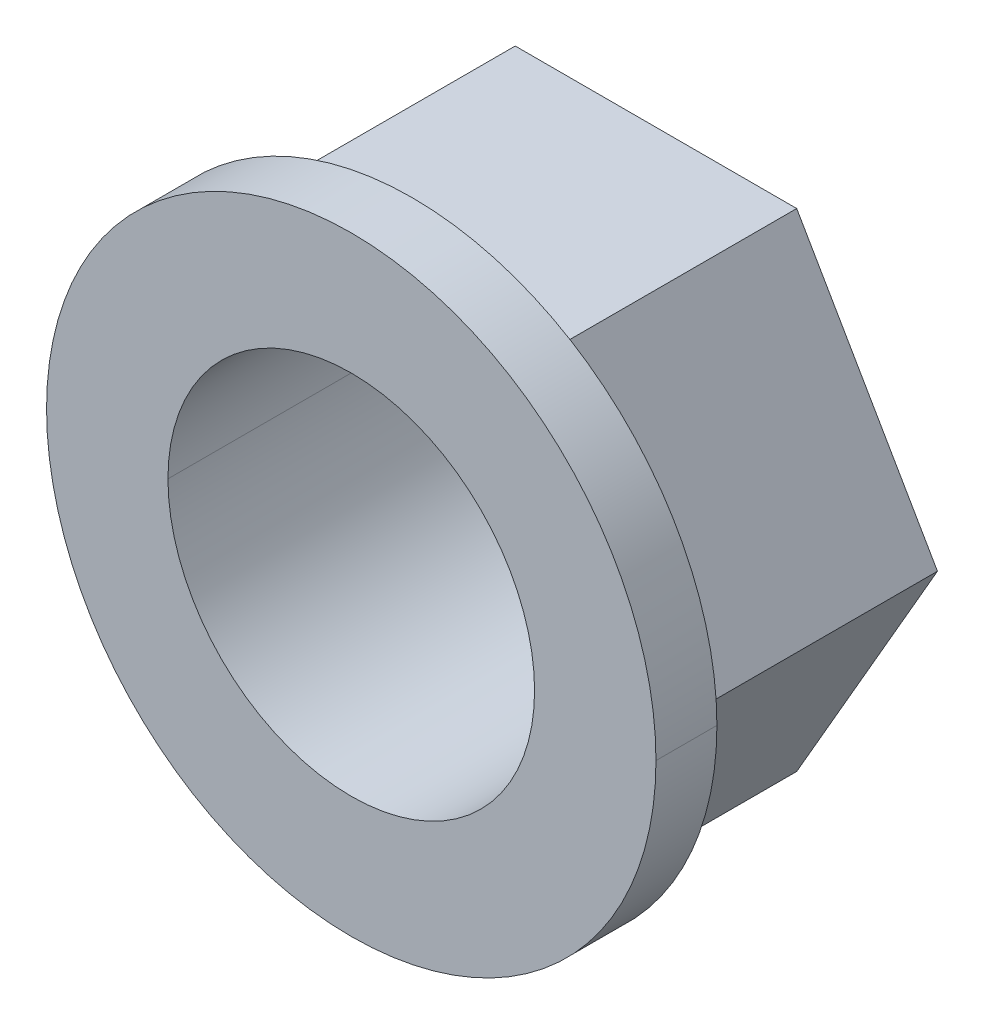
ISO-10303-21;
HEADER;
FILE_DESCRIPTION(('STEP AP214'),'2;1');
FILE_NAME('part.step','',(''),(''),'','','');
FILE_SCHEMA(('AUTOMOTIVE_DESIGN { 1 0 10303 214 1 1 1 1 }'));
ENDSEC;
DATA;
#1=APPLICATION_CONTEXT('core data for automotive mechanical design processes');
#2=APPLICATION_PROTOCOL_DEFINITION('international standard','automotive_design',2000,#1);
#3=PRODUCT_CONTEXT('',#1,'mechanical');
#4=PRODUCT('Part','Part','',(#3));
#5=PRODUCT_RELATED_PRODUCT_CATEGORY('part','',(#4));
#6=PRODUCT_DEFINITION_FORMATION('','',#4);
#7=PRODUCT_DEFINITION_CONTEXT('part definition',#1,'design');
#8=PRODUCT_DEFINITION('design','',#6,#7);
#9=PRODUCT_DEFINITION_SHAPE('','',#8);
#10=(LENGTH_UNIT() NAMED_UNIT(*) SI_UNIT(.MILLI.,.METRE.));
#11=(NAMED_UNIT(*) PLANE_ANGLE_UNIT() SI_UNIT($,.RADIAN.));
#12=(NAMED_UNIT(*) SI_UNIT($,.STERADIAN.) SOLID_ANGLE_UNIT());
#13=UNCERTAINTY_MEASURE_WITH_UNIT(LENGTH_MEASURE(1.E-05),#10,'distance_accuracy_value','');
#14=(GEOMETRIC_REPRESENTATION_CONTEXT(3) GLOBAL_UNCERTAINTY_ASSIGNED_CONTEXT((#13)) GLOBAL_UNIT_ASSIGNED_CONTEXT((#10,
#11,#12)) REPRESENTATION_CONTEXT('',''));
#15=CARTESIAN_POINT('',(0.,0.,0.));
#16=DIRECTION('',(0.,0.,1.));
#17=DIRECTION('',(1.,0.,0.));
#18=AXIS2_PLACEMENT_3D('',#15,#16,#17);
#19=CARTESIAN_POINT('',(0.,0.,1.5875));
#20=DIRECTION('',(0.,0.,-1.));
#21=DIRECTION('',(-1.,0.,0.));
#22=AXIS2_PLACEMENT_3D('',#19,#20,#21);
#23=CYLINDRICAL_SURFACE('',#22,7.9375);
#24=DIRECTION('',(0.,0.,-1.));
#25=VECTOR('',#24,1.);
#26=CARTESIAN_POINT('',(7.9375,0.,1.5875));
#27=LINE('',#26,#25);
#28=CARTESIAN_POINT('',(7.9375,0.,1.5875));
#29=VERTEX_POINT('',#28);
#30=CARTESIAN_POINT('',(7.9375,0.,0.));
#31=VERTEX_POINT('',#30);
#32=EDGE_CURVE('E214',#29,#31,#27,.T.);
#33=ORIENTED_EDGE('',*,*,#32,.F.);
#34=CARTESIAN_POINT('',(0.,0.,1.5875));
#35=DIRECTION('',(0.,0.,1.));
#36=DIRECTION('',(1.,0.,0.));
#37=AXIS2_PLACEMENT_3D('',#34,#35,#36);
#38=CIRCLE('',#37,7.9375);
#39=CARTESIAN_POINT('',(-7.9375,0.,1.5875));
#40=VERTEX_POINT('',#39);
#41=EDGE_CURVE('E11',#40,#29,#38,.T.);
#42=ORIENTED_EDGE('',*,*,#41,.F.);
#43=DIRECTION('',(0.,0.,-1.));
#44=VECTOR('',#43,1.);
#45=CARTESIAN_POINT('',(-7.9375,0.,1.5875));
#46=LINE('',#45,#44);
#47=CARTESIAN_POINT('',(-7.9375,0.,0.));
#48=VERTEX_POINT('',#47);
#49=EDGE_CURVE('E211',#40,#48,#46,.T.);
#50=ORIENTED_EDGE('',*,*,#49,.T.);
#51=CARTESIAN_POINT('',(0.,0.,0.));
#52=DIRECTION('',(0.,0.,1.));
#53=DIRECTION('',(1.,0.,0.));
#54=AXIS2_PLACEMENT_3D('',#51,#52,#53);
#55=CIRCLE('',#54,7.9375);
#56=EDGE_CURVE('E21',#48,#31,#55,.T.);
#57=ORIENTED_EDGE('',*,*,#56,.T.);
#58=EDGE_LOOP('',(#33,#42,#50,#57));
#59=FACE_BOUND('',#58,.T.);
#60=ADVANCED_FACE('F17',(#59),#23,.T.);
#61=CARTESIAN_POINT('',(0.,0.,1.5875));
#62=DIRECTION('',(0.,0.,1.));
#63=DIRECTION('',(1.,0.,0.));
#64=AXIS2_PLACEMENT_3D('',#61,#62,#63);
#65=PLANE('',#64);
#66=CARTESIAN_POINT('',(0.,0.,1.5875));
#67=DIRECTION('',(0.,0.,1.));
#68=DIRECTION('',(1.,0.,0.));
#69=AXIS2_PLACEMENT_3D('',#66,#67,#68);
#70=CIRCLE('',#69,4.7752);
#71=CARTESIAN_POINT('',(4.7752,0.,1.5875));
#72=VERTEX_POINT('',#71);
#73=CARTESIAN_POINT('',(-4.7752,0.,1.5875));
#74=VERTEX_POINT('',#73);
#75=EDGE_CURVE('E131',#72,#74,#70,.T.);
#76=ORIENTED_EDGE('',*,*,#75,.F.);
#77=CARTESIAN_POINT('',(0.,0.,1.5875));
#78=DIRECTION('',(0.,0.,1.));
#79=DIRECTION('',(1.,0.,0.));
#80=AXIS2_PLACEMENT_3D('',#77,#78,#79);
#81=CIRCLE('',#80,4.7752);
#82=EDGE_CURVE('E190',#74,#72,#81,.T.);
#83=ORIENTED_EDGE('',*,*,#82,.F.);
#84=EDGE_LOOP('',(#76,#83));
#85=FACE_BOUND('',#84,.T.);
#86=ORIENTED_EDGE('',*,*,#41,.T.);
#87=CARTESIAN_POINT('',(0.,0.,1.5875));
#88=DIRECTION('',(0.,0.,1.));
#89=DIRECTION('',(1.,0.,0.));
#90=AXIS2_PLACEMENT_3D('',#87,#88,#89);
#91=CIRCLE('',#90,7.9375);
#92=EDGE_CURVE('E219',#29,#40,#91,.T.);
#93=ORIENTED_EDGE('',*,*,#92,.T.);
#94=EDGE_LOOP('',(#86,#93));
#95=FACE_BOUND('',#94,.T.);
#96=ADVANCED_FACE('F269',(#85,#95),#65,.T.);
#97=CARTESIAN_POINT('',(0.,0.,0.));
#98=DIRECTION('',(0.,0.,1.));
#99=DIRECTION('',(1.,0.,0.));
#100=AXIS2_PLACEMENT_3D('',#97,#98,#99);
#101=PLANE('',#100);
#102=DIRECTION('',(1.,0.,0.));
#103=VECTOR('',#102,1.);
#104=CARTESIAN_POINT('',(-3.66617420935412,-6.35,0.));
#105=LINE('',#104,#103);
#106=CARTESIAN_POINT('',(-3.66617420935412,-6.35,0.));
#107=VERTEX_POINT('',#106);
#108=CARTESIAN_POINT('',(3.66617420935412,-6.35,0.));
#109=VERTEX_POINT('',#108);
#110=EDGE_CURVE('E118',#107,#109,#105,.T.);
#111=ORIENTED_EDGE('',*,*,#110,.T.);
#112=DIRECTION('',(0.5,0.866025403784439,0.));
#113=VECTOR('',#112,1.);
#114=CARTESIAN_POINT('',(3.66617420935412,-6.35,0.));
#115=LINE('',#114,#113);
#116=CARTESIAN_POINT('',(7.33234841870825,0.,0.));
#117=VERTEX_POINT('',#116);
#118=EDGE_CURVE('E202',#109,#117,#115,.T.);
#119=ORIENTED_EDGE('',*,*,#118,.T.);
#120=DIRECTION('',(-0.5,0.866025403784439,0.));
#121=VECTOR('',#120,1.);
#122=CARTESIAN_POINT('',(7.33234841870825,0.,0.));
#123=LINE('',#122,#121);
#124=CARTESIAN_POINT('',(3.66617420935412,6.35,0.));
#125=VERTEX_POINT('',#124);
#126=EDGE_CURVE('E187',#117,#125,#123,.T.);
#127=ORIENTED_EDGE('',*,*,#126,.T.);
#128=DIRECTION('',(-1.,0.,0.));
#129=VECTOR('',#128,1.);
#130=CARTESIAN_POINT('',(3.66617420935412,6.35,0.));
#131=LINE('',#130,#129);
#132=CARTESIAN_POINT('',(-3.66617420935412,6.35,0.));
#133=VERTEX_POINT('',#132);
#134=EDGE_CURVE('E164',#125,#133,#131,.T.);
#135=ORIENTED_EDGE('',*,*,#134,.T.);
#136=DIRECTION('',(-0.5,-0.866025403784439,0.));
#137=VECTOR('',#136,1.);
#138=CARTESIAN_POINT('',(-3.66617420935412,6.35,0.));
#139=LINE('',#138,#137);
#140=CARTESIAN_POINT('',(-7.33234841870825,0.,0.));
#141=VERTEX_POINT('',#140);
#142=EDGE_CURVE('E173',#133,#141,#139,.T.);
#143=ORIENTED_EDGE('',*,*,#142,.T.);
#144=DIRECTION('',(0.5,-0.866025403784439,0.));
#145=VECTOR('',#144,1.);
#146=CARTESIAN_POINT('',(-7.33234841870825,0.,0.));
#147=LINE('',#146,#145);
#148=EDGE_CURVE('E66',#141,#107,#147,.T.);
#149=ORIENTED_EDGE('',*,*,#148,.T.);
#150=EDGE_LOOP('',(#111,#119,#127,#135,#143,#149));
#151=FACE_BOUND('',#150,.T.);
#152=ORIENTED_EDGE('',*,*,#56,.F.);
#153=CARTESIAN_POINT('',(0.,0.,0.));
#154=DIRECTION('',(0.,0.,1.));
#155=DIRECTION('',(1.,0.,0.));
#156=AXIS2_PLACEMENT_3D('',#153,#154,#155);
#157=CIRCLE('',#156,7.9375);
#158=EDGE_CURVE('E218',#31,#48,#157,.T.);
#159=ORIENTED_EDGE('',*,*,#158,.F.);
#160=EDGE_LOOP('',(#152,#159));
#161=FACE_BOUND('',#160,.T.);
#162=ADVANCED_FACE('F266',(#151,#161),#101,.F.);
#163=CARTESIAN_POINT('',(0.,0.,-6.35));
#164=DIRECTION('',(0.,0.,1.));
#165=DIRECTION('',(1.,0.,0.));
#166=AXIS2_PLACEMENT_3D('',#163,#164,#165);
#167=CYLINDRICAL_SURFACE('',#166,4.7752);
#168=DIRECTION('',(0.,0.,1.));
#169=VECTOR('',#168,1.);
#170=CARTESIAN_POINT('',(-4.7752,0.,-6.35));
#171=LINE('',#170,#169);
#172=CARTESIAN_POINT('',(-4.7752,0.,-6.35));
#173=VERTEX_POINT('',#172);
#174=EDGE_CURVE('E194',#173,#74,#171,.T.);
#175=ORIENTED_EDGE('',*,*,#174,.F.);
#176=CARTESIAN_POINT('',(0.,0.,-6.35));
#177=DIRECTION('',(0.,0.,1.));
#178=DIRECTION('',(1.,0.,0.));
#179=AXIS2_PLACEMENT_3D('',#176,#177,#178);
#180=CIRCLE('',#179,4.7752);
#181=CARTESIAN_POINT('',(4.7752,0.,-6.35));
#182=VERTEX_POINT('',#181);
#183=EDGE_CURVE('E238',#182,#173,#180,.T.);
#184=ORIENTED_EDGE('',*,*,#183,.F.);
#185=DIRECTION('',(0.,0.,1.));
#186=VECTOR('',#185,1.);
#187=CARTESIAN_POINT('',(4.7752,0.,-6.35));
#188=LINE('',#187,#186);
#189=EDGE_CURVE('E193',#182,#72,#188,.T.);
#190=ORIENTED_EDGE('',*,*,#189,.T.);
#191=ORIENTED_EDGE('',*,*,#75,.T.);
#192=EDGE_LOOP('',(#175,#184,#190,#191));
#193=FACE_BOUND('',#192,.T.);
#194=ADVANCED_FACE('F278',(#193),#167,.F.);
#195=CARTESIAN_POINT('',(0.,0.,-6.35));
#196=DIRECTION('',(0.,0.,1.));
#197=DIRECTION('',(1.,0.,0.));
#198=AXIS2_PLACEMENT_3D('',#195,#196,#197);
#199=PLANE('',#198);
#200=ORIENTED_EDGE('',*,*,#183,.T.);
#201=CARTESIAN_POINT('',(0.,0.,-6.35));
#202=DIRECTION('',(0.,0.,1.));
#203=DIRECTION('',(1.,0.,0.));
#204=AXIS2_PLACEMENT_3D('',#201,#202,#203);
#205=CIRCLE('',#204,4.7752);
#206=EDGE_CURVE('E204',#173,#182,#205,.T.);
#207=ORIENTED_EDGE('',*,*,#206,.T.);
#208=EDGE_LOOP('',(#200,#207));
#209=FACE_BOUND('',#208,.T.);
#210=DIRECTION('',(0.5,0.866025403784439,0.));
#211=VECTOR('',#210,1.);
#212=CARTESIAN_POINT('',(3.66617420935412,-6.35,-6.35));
#213=LINE('',#212,#211);
#214=CARTESIAN_POINT('',(3.66617420935412,-6.35,-6.35));
#215=VERTEX_POINT('',#214);
#216=CARTESIAN_POINT('',(7.33234841870825,0.,-6.35));
#217=VERTEX_POINT('',#216);
#218=EDGE_CURVE('E185',#215,#217,#213,.T.);
#219=ORIENTED_EDGE('',*,*,#218,.F.);
#220=DIRECTION('',(1.,0.,0.));
#221=VECTOR('',#220,1.);
#222=CARTESIAN_POINT('',(-3.66617420935412,-6.35,-6.35));
#223=LINE('',#222,#221);
#224=CARTESIAN_POINT('',(-3.66617420935412,-6.35,-6.35));
#225=VERTEX_POINT('',#224);
#226=EDGE_CURVE('E169',#225,#215,#223,.T.);
#227=ORIENTED_EDGE('',*,*,#226,.F.);
#228=DIRECTION('',(0.5,-0.866025403784439,0.));
#229=VECTOR('',#228,1.);
#230=CARTESIAN_POINT('',(-7.33234841870825,0.,-6.35));
#231=LINE('',#230,#229);
#232=CARTESIAN_POINT('',(-7.33234841870825,0.,-6.35));
#233=VERTEX_POINT('',#232);
#234=EDGE_CURVE('E167',#233,#225,#231,.T.);
#235=ORIENTED_EDGE('',*,*,#234,.F.);
#236=DIRECTION('',(-0.5,-0.866025403784439,0.));
#237=VECTOR('',#236,1.);
#238=CARTESIAN_POINT('',(-3.66617420935412,6.35,-6.35));
#239=LINE('',#238,#237);
#240=CARTESIAN_POINT('',(-3.66617420935412,6.35,-6.35));
#241=VERTEX_POINT('',#240);
#242=EDGE_CURVE('E155',#241,#233,#239,.T.);
#243=ORIENTED_EDGE('',*,*,#242,.F.);
#244=DIRECTION('',(-1.,0.,0.));
#245=VECTOR('',#244,1.);
#246=CARTESIAN_POINT('',(3.66617420935412,6.35,-6.35));
#247=LINE('',#246,#245);
#248=CARTESIAN_POINT('',(3.66617420935412,6.35,-6.35));
#249=VERTEX_POINT('',#248);
#250=EDGE_CURVE('E189',#249,#241,#247,.T.);
#251=ORIENTED_EDGE('',*,*,#250,.F.);
#252=DIRECTION('',(-0.5,0.866025403784439,0.));
#253=VECTOR('',#252,1.);
#254=CARTESIAN_POINT('',(7.33234841870825,0.,-6.35));
#255=LINE('',#254,#253);
#256=EDGE_CURVE('E42',#217,#249,#255,.T.);
#257=ORIENTED_EDGE('',*,*,#256,.F.);
#258=EDGE_LOOP('',(#219,#227,#235,#243,#251,#257));
#259=FACE_BOUND('',#258,.T.);
#260=ADVANCED_FACE('F168',(#209,#259),#199,.F.);
#261=CARTESIAN_POINT('',(7.33234841870825,0.,-6.35));
#262=DIRECTION('',(0.866025403784439,0.5,0.));
#263=DIRECTION('',(0.,0.,-1.));
#264=AXIS2_PLACEMENT_3D('',#261,#262,#263);
#265=PLANE('',#264);
#266=ORIENTED_EDGE('',*,*,#126,.F.);
#267=DIRECTION('',(0.,0.,1.));
#268=VECTOR('',#267,1.);
#269=CARTESIAN_POINT('',(7.33234841870825,0.,-6.35));
#270=LINE('',#269,#268);
#271=EDGE_CURVE('E242',#217,#117,#270,.T.);
#272=ORIENTED_EDGE('',*,*,#271,.F.);
#273=ORIENTED_EDGE('',*,*,#256,.T.);
#274=DIRECTION('',(0.,0.,1.));
#275=VECTOR('',#274,1.);
#276=CARTESIAN_POINT('',(3.66617420935412,6.35,-6.35));
#277=LINE('',#276,#275);
#278=EDGE_CURVE('E235',#249,#125,#277,.T.);
#279=ORIENTED_EDGE('',*,*,#278,.T.);
#280=EDGE_LOOP('',(#266,#272,#273,#279));
#281=FACE_BOUND('',#280,.T.);
#282=ADVANCED_FACE('F282',(#281),#265,.T.);
#283=CARTESIAN_POINT('',(3.66617420935412,6.35,-6.35));
#284=DIRECTION('',(0.,1.,0.));
#285=DIRECTION('',(1.,0.,0.));
#286=AXIS2_PLACEMENT_3D('',#283,#284,#285);
#287=PLANE('',#286);
#288=ORIENTED_EDGE('',*,*,#134,.F.);
#289=ORIENTED_EDGE('',*,*,#278,.F.);
#290=ORIENTED_EDGE('',*,*,#250,.T.);
#291=DIRECTION('',(0.,0.,1.));
#292=VECTOR('',#291,1.);
#293=CARTESIAN_POINT('',(-3.66617420935412,6.35,-6.35));
#294=LINE('',#293,#292);
#295=EDGE_CURVE('E162',#241,#133,#294,.T.);
#296=ORIENTED_EDGE('',*,*,#295,.T.);
#297=EDGE_LOOP('',(#288,#289,#290,#296));
#298=FACE_BOUND('',#297,.T.);
#299=ADVANCED_FACE('F300',(#298),#287,.T.);
#300=CARTESIAN_POINT('',(-3.66617420935412,6.35,-6.35));
#301=DIRECTION('',(-0.866025403784439,0.5,0.));
#302=DIRECTION('',(0.,0.,1.));
#303=AXIS2_PLACEMENT_3D('',#300,#301,#302);
#304=PLANE('',#303);
#305=ORIENTED_EDGE('',*,*,#142,.F.);
#306=ORIENTED_EDGE('',*,*,#295,.F.);
#307=ORIENTED_EDGE('',*,*,#242,.T.);
#308=DIRECTION('',(0.,0.,1.));
#309=VECTOR('',#308,1.);
#310=CARTESIAN_POINT('',(-7.33234841870825,0.,-6.35));
#311=LINE('',#310,#309);
#312=EDGE_CURVE('E160',#233,#141,#311,.T.);
#313=ORIENTED_EDGE('',*,*,#312,.T.);
#314=EDGE_LOOP('',(#305,#306,#307,#313));
#315=FACE_BOUND('',#314,.T.);
#316=ADVANCED_FACE('F158',(#315),#304,.T.);
#317=CARTESIAN_POINT('',(-7.33234841870825,0.,-6.35));
#318=DIRECTION('',(-0.866025403784438,-0.5,0.));
#319=DIRECTION('',(-0.5,0.866025403784438,0.));
#320=AXIS2_PLACEMENT_3D('',#317,#318,#319);
#321=PLANE('',#320);
#322=ORIENTED_EDGE('',*,*,#148,.F.);
#323=ORIENTED_EDGE('',*,*,#312,.F.);
#324=ORIENTED_EDGE('',*,*,#234,.T.);
#325=DIRECTION('',(0.,0.,1.));
#326=VECTOR('',#325,1.);
#327=CARTESIAN_POINT('',(-3.66617420935412,-6.35,-6.35));
#328=LINE('',#327,#326);
#329=EDGE_CURVE('E223',#225,#107,#328,.T.);
#330=ORIENTED_EDGE('',*,*,#329,.T.);
#331=EDGE_LOOP('',(#322,#323,#324,#330));
#332=FACE_BOUND('',#331,.T.);
#333=ADVANCED_FACE('F175',(#332),#321,.T.);
#334=CARTESIAN_POINT('',(-3.66617420935412,-6.35,-6.35));
#335=DIRECTION('',(0.,-1.,0.));
#336=DIRECTION('',(0.,0.,-1.));
#337=AXIS2_PLACEMENT_3D('',#334,#335,#336);
#338=PLANE('',#337);
#339=ORIENTED_EDGE('',*,*,#110,.F.);
#340=ORIENTED_EDGE('',*,*,#329,.F.);
#341=ORIENTED_EDGE('',*,*,#226,.T.);
#342=DIRECTION('',(0.,0.,1.));
#343=VECTOR('',#342,1.);
#344=CARTESIAN_POINT('',(3.66617420935412,-6.35,-6.35));
#345=LINE('',#344,#343);
#346=EDGE_CURVE('E220',#215,#109,#345,.T.);
#347=ORIENTED_EDGE('',*,*,#346,.T.);
#348=EDGE_LOOP('',(#339,#340,#341,#347));
#349=FACE_BOUND('',#348,.T.);
#350=ADVANCED_FACE('F286',(#349),#338,.T.);
#351=CARTESIAN_POINT('',(3.66617420935412,-6.35,-6.35));
#352=DIRECTION('',(0.866025403784439,-0.5,0.));
#353=DIRECTION('',(0.,0.,-1.));
#354=AXIS2_PLACEMENT_3D('',#351,#352,#353);
#355=PLANE('',#354);
#356=ORIENTED_EDGE('',*,*,#118,.F.);
#357=ORIENTED_EDGE('',*,*,#346,.F.);
#358=ORIENTED_EDGE('',*,*,#218,.T.);
#359=ORIENTED_EDGE('',*,*,#271,.T.);
#360=EDGE_LOOP('',(#356,#357,#358,#359));
#361=FACE_BOUND('',#360,.T.);
#362=ADVANCED_FACE('F291',(#361),#355,.T.);
#363=CARTESIAN_POINT('',(0.,0.,-6.35));
#364=DIRECTION('',(0.,0.,1.));
#365=DIRECTION('',(1.,0.,0.));
#366=AXIS2_PLACEMENT_3D('',#363,#364,#365);
#367=CYLINDRICAL_SURFACE('',#366,4.7752);
#368=ORIENTED_EDGE('',*,*,#206,.F.);
#369=ORIENTED_EDGE('',*,*,#174,.T.);
#370=ORIENTED_EDGE('',*,*,#82,.T.);
#371=ORIENTED_EDGE('',*,*,#189,.F.);
#372=EDGE_LOOP('',(#368,#369,#370,#371));
#373=FACE_BOUND('',#372,.T.);
#374=ADVANCED_FACE('F289',(#373),#367,.F.);
#375=CARTESIAN_POINT('',(0.,0.,1.5875));
#376=DIRECTION('',(0.,0.,-1.));
#377=DIRECTION('',(-1.,0.,0.));
#378=AXIS2_PLACEMENT_3D('',#375,#376,#377);
#379=CYLINDRICAL_SURFACE('',#378,7.9375);
#380=ORIENTED_EDGE('',*,*,#92,.F.);
#381=ORIENTED_EDGE('',*,*,#32,.T.);
#382=ORIENTED_EDGE('',*,*,#158,.T.);
#383=ORIENTED_EDGE('',*,*,#49,.F.);
#384=EDGE_LOOP('',(#380,#381,#382,#383));
#385=FACE_BOUND('',#384,.T.);
#386=ADVANCED_FACE('F19',(#385),#379,.T.);
#387=CLOSED_SHELL('',(#60,#96,#162,#194,#260,#282,#299,#316,#333,#350,#362,#374,#386));
#388=MANIFOLD_SOLID_BREP('B1',#387);
#389=ADVANCED_BREP_SHAPE_REPRESENTATION('',(#18,#388),#14);
#390=SHAPE_DEFINITION_REPRESENTATION(#9,#389);
ENDSEC;
END-ISO-10303-21;
